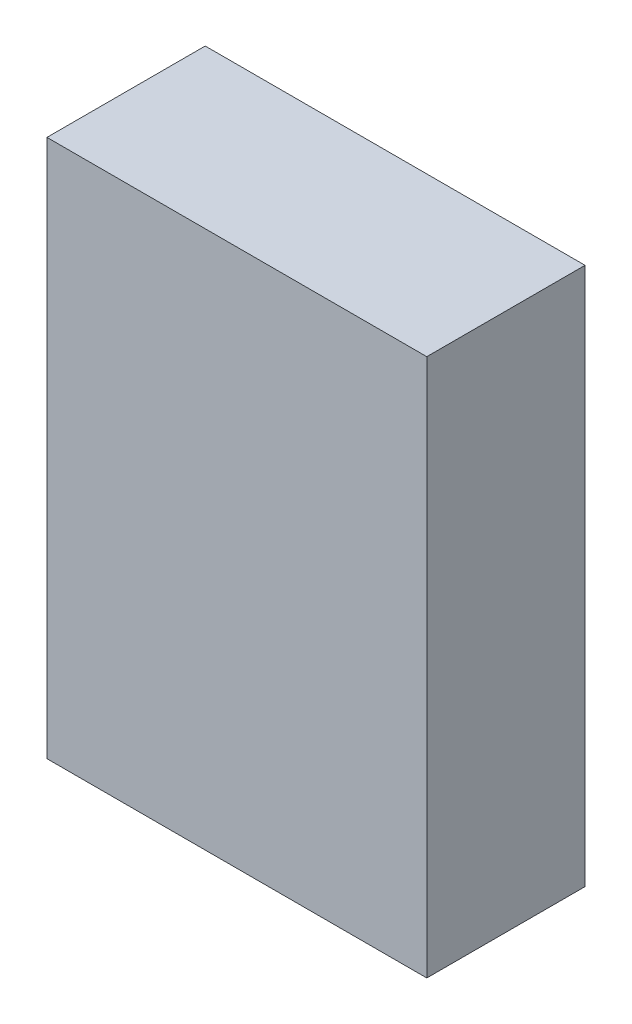
ISO-10303-21;
HEADER;
FILE_DESCRIPTION(('STEP AP214'),'2;1');
FILE_NAME('part.step','',(''),(''),'','','');
FILE_SCHEMA(('AUTOMOTIVE_DESIGN { 1 0 10303 214 1 1 1 1 }'));
ENDSEC;
DATA;
#1=APPLICATION_CONTEXT('core data for automotive mechanical design processes');
#2=APPLICATION_PROTOCOL_DEFINITION('international standard','automotive_design',2000,#1);
#3=PRODUCT_CONTEXT('',#1,'mechanical');
#4=PRODUCT('Part','Part','',(#3));
#5=PRODUCT_RELATED_PRODUCT_CATEGORY('part','',(#4));
#6=PRODUCT_DEFINITION_FORMATION('','',#4);
#7=PRODUCT_DEFINITION_CONTEXT('part definition',#1,'design');
#8=PRODUCT_DEFINITION('design','',#6,#7);
#9=PRODUCT_DEFINITION_SHAPE('','',#8);
#10=(LENGTH_UNIT() NAMED_UNIT(*) SI_UNIT(.MILLI.,.METRE.));
#11=(NAMED_UNIT(*) PLANE_ANGLE_UNIT() SI_UNIT($,.RADIAN.));
#12=(NAMED_UNIT(*) SI_UNIT($,.STERADIAN.) SOLID_ANGLE_UNIT());
#13=UNCERTAINTY_MEASURE_WITH_UNIT(LENGTH_MEASURE(1.E-05),#10,'distance_accuracy_value','');
#14=(GEOMETRIC_REPRESENTATION_CONTEXT(3) GLOBAL_UNCERTAINTY_ASSIGNED_CONTEXT((#13)) GLOBAL_UNIT_ASSIGNED_CONTEXT((#10,
#11,#12)) REPRESENTATION_CONTEXT('',''));
#15=CARTESIAN_POINT('',(0.,0.,0.));
#16=DIRECTION('',(0.,0.,1.));
#17=DIRECTION('',(1.,0.,0.));
#18=AXIS2_PLACEMENT_3D('',#15,#16,#17);
#19=CARTESIAN_POINT('',(2.13,2.58,0.));
#20=DIRECTION('',(1.,0.,0.));
#21=DIRECTION('',(0.,0.,1.));
#22=AXIS2_PLACEMENT_3D('',#19,#20,#21);
#23=PLANE('',#22);
#24=DIRECTION('',(0.,1.,0.));
#25=VECTOR('',#24,1.);
#26=CARTESIAN_POINT('',(2.13,2.58,0.1));
#27=LINE('',#26,#25);
#28=CARTESIAN_POINT('',(2.13,2.58,0.1));
#29=VERTEX_POINT('',#28);
#30=CARTESIAN_POINT('',(2.13,2.92,0.1));
#31=VERTEX_POINT('',#30);
#32=EDGE_CURVE('E11',#29,#31,#27,.T.);
#33=ORIENTED_EDGE('',*,*,#32,.T.);
#34=DIRECTION('',(0.,0.,1.));
#35=VECTOR('',#34,1.);
#36=CARTESIAN_POINT('',(2.13,2.92,0.));
#37=LINE('',#36,#35);
#38=CARTESIAN_POINT('',(2.13,2.92,0.));
#39=VERTEX_POINT('',#38);
#40=EDGE_CURVE('E24',#39,#31,#37,.T.);
#41=ORIENTED_EDGE('',*,*,#40,.F.);
#42=DIRECTION('',(0.,1.,0.));
#43=VECTOR('',#42,1.);
#44=CARTESIAN_POINT('',(2.13,2.58,0.));
#45=LINE('',#44,#43);
#46=CARTESIAN_POINT('',(2.13,2.58,0.));
#47=VERTEX_POINT('',#46);
#48=EDGE_CURVE('E86',#47,#39,#45,.T.);
#49=ORIENTED_EDGE('',*,*,#48,.F.);
#50=DIRECTION('',(0.,0.,1.));
#51=VECTOR('',#50,1.);
#52=CARTESIAN_POINT('',(2.13,2.58,0.));
#53=LINE('',#52,#51);
#54=EDGE_CURVE('E36',#47,#29,#53,.T.);
#55=ORIENTED_EDGE('',*,*,#54,.T.);
#56=EDGE_LOOP('',(#33,#41,#49,#55));
#57=FACE_BOUND('',#56,.T.);
#58=ADVANCED_FACE('F17',(#57),#23,.F.);
#59=CARTESIAN_POINT('',(2.37,2.58,0.));
#60=DIRECTION('',(1.,0.,0.));
#61=DIRECTION('',(0.,0.,1.));
#62=AXIS2_PLACEMENT_3D('',#59,#60,#61);
#63=PLANE('',#62);
#64=DIRECTION('',(0.,0.,1.));
#65=VECTOR('',#64,1.);
#66=CARTESIAN_POINT('',(2.37,2.58,0.));
#67=LINE('',#66,#65);
#68=CARTESIAN_POINT('',(2.37,2.58,0.));
#69=VERTEX_POINT('',#68);
#70=CARTESIAN_POINT('',(2.37,2.58,0.1));
#71=VERTEX_POINT('',#70);
#72=EDGE_CURVE('E83',#69,#71,#67,.T.);
#73=ORIENTED_EDGE('',*,*,#72,.F.);
#74=DIRECTION('',(0.,1.,0.));
#75=VECTOR('',#74,1.);
#76=CARTESIAN_POINT('',(2.37,2.58,0.));
#77=LINE('',#76,#75);
#78=CARTESIAN_POINT('',(2.37,2.92,0.));
#79=VERTEX_POINT('',#78);
#80=EDGE_CURVE('E63',#69,#79,#77,.T.);
#81=ORIENTED_EDGE('',*,*,#80,.T.);
#82=DIRECTION('',(0.,0.,1.));
#83=VECTOR('',#82,1.);
#84=CARTESIAN_POINT('',(2.37,2.92,0.));
#85=LINE('',#84,#83);
#86=CARTESIAN_POINT('',(2.37,2.92,0.1));
#87=VERTEX_POINT('',#86);
#88=EDGE_CURVE('E57',#79,#87,#85,.T.);
#89=ORIENTED_EDGE('',*,*,#88,.T.);
#90=DIRECTION('',(0.,1.,0.));
#91=VECTOR('',#90,1.);
#92=CARTESIAN_POINT('',(2.37,2.58,0.1));
#93=LINE('',#92,#91);
#94=EDGE_CURVE('E60',#71,#87,#93,.T.);
#95=ORIENTED_EDGE('',*,*,#94,.F.);
#96=EDGE_LOOP('',(#73,#81,#89,#95));
#97=FACE_BOUND('',#96,.T.);
#98=ADVANCED_FACE('F59',(#97),#63,.T.);
#99=CARTESIAN_POINT('',(2.13,2.58,0.));
#100=DIRECTION('',(0.,1.,0.));
#101=DIRECTION('',(0.,0.,1.));
#102=AXIS2_PLACEMENT_3D('',#99,#100,#101);
#103=PLANE('',#102);
#104=ORIENTED_EDGE('',*,*,#72,.T.);
#105=DIRECTION('',(1.,0.,0.));
#106=VECTOR('',#105,1.);
#107=CARTESIAN_POINT('',(2.13,2.58,0.1));
#108=LINE('',#107,#106);
#109=EDGE_CURVE('E71',#29,#71,#108,.T.);
#110=ORIENTED_EDGE('',*,*,#109,.F.);
#111=ORIENTED_EDGE('',*,*,#54,.F.);
#112=DIRECTION('',(1.,0.,0.));
#113=VECTOR('',#112,1.);
#114=CARTESIAN_POINT('',(2.13,2.58,0.));
#115=LINE('',#114,#113);
#116=EDGE_CURVE('E76',#47,#69,#115,.T.);
#117=ORIENTED_EDGE('',*,*,#116,.T.);
#118=EDGE_LOOP('',(#104,#110,#111,#117));
#119=FACE_BOUND('',#118,.T.);
#120=ADVANCED_FACE('F91',(#119),#103,.F.);
#121=CARTESIAN_POINT('',(2.13,2.92,0.));
#122=DIRECTION('',(0.,1.,0.));
#123=DIRECTION('',(0.,0.,1.));
#124=AXIS2_PLACEMENT_3D('',#121,#122,#123);
#125=PLANE('',#124);
#126=DIRECTION('',(1.,0.,0.));
#127=VECTOR('',#126,1.);
#128=CARTESIAN_POINT('',(2.13,2.92,0.));
#129=LINE('',#128,#127);
#130=EDGE_CURVE('E74',#39,#79,#129,.T.);
#131=ORIENTED_EDGE('',*,*,#130,.F.);
#132=ORIENTED_EDGE('',*,*,#40,.T.);
#133=DIRECTION('',(1.,0.,0.));
#134=VECTOR('',#133,1.);
#135=CARTESIAN_POINT('',(2.13,2.92,0.1));
#136=LINE('',#135,#134);
#137=EDGE_CURVE('E69',#31,#87,#136,.T.);
#138=ORIENTED_EDGE('',*,*,#137,.T.);
#139=ORIENTED_EDGE('',*,*,#88,.F.);
#140=EDGE_LOOP('',(#131,#132,#138,#139));
#141=FACE_BOUND('',#140,.T.);
#142=ADVANCED_FACE('F73',(#141),#125,.T.);
#143=CARTESIAN_POINT('',(2.13,2.58,0.));
#144=DIRECTION('',(0.,0.,1.));
#145=DIRECTION('',(1.,0.,0.));
#146=AXIS2_PLACEMENT_3D('',#143,#144,#145);
#147=PLANE('',#146);
#148=ORIENTED_EDGE('',*,*,#130,.T.);
#149=ORIENTED_EDGE('',*,*,#80,.F.);
#150=ORIENTED_EDGE('',*,*,#116,.F.);
#151=ORIENTED_EDGE('',*,*,#48,.T.);
#152=EDGE_LOOP('',(#148,#149,#150,#151));
#153=FACE_BOUND('',#152,.T.);
#154=ADVANCED_FACE('F89',(#153),#147,.F.);
#155=CARTESIAN_POINT('',(2.13,2.58,0.1));
#156=DIRECTION('',(0.,0.,1.));
#157=DIRECTION('',(1.,0.,0.));
#158=AXIS2_PLACEMENT_3D('',#155,#156,#157);
#159=PLANE('',#158);
#160=ORIENTED_EDGE('',*,*,#32,.F.);
#161=ORIENTED_EDGE('',*,*,#109,.T.);
#162=ORIENTED_EDGE('',*,*,#94,.T.);
#163=ORIENTED_EDGE('',*,*,#137,.F.);
#164=EDGE_LOOP('',(#160,#161,#162,#163));
#165=FACE_BOUND('',#164,.T.);
#166=ADVANCED_FACE('F68',(#165),#159,.T.);
#167=CLOSED_SHELL('',(#58,#98,#120,#142,#154,#166));
#168=MANIFOLD_SOLID_BREP('B1',#167);
#169=ADVANCED_BREP_SHAPE_REPRESENTATION('',(#18,#168),#14);
#170=SHAPE_DEFINITION_REPRESENTATION(#9,#169);
ENDSEC;
END-ISO-10303-21;
